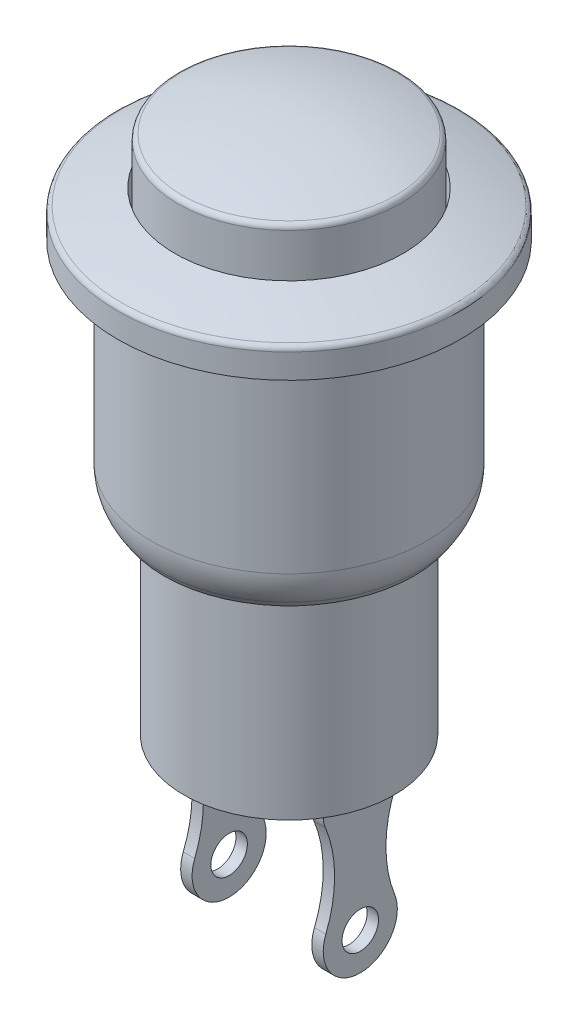
ISO-10303-21;
HEADER;
FILE_DESCRIPTION(('STEP AP214'),'2;1');
FILE_NAME('part.step','',(''),(''),'','','');
FILE_SCHEMA(('AUTOMOTIVE_DESIGN { 1 0 10303 214 1 1 1 1 }'));
ENDSEC;
DATA;
#1=APPLICATION_CONTEXT('core data for automotive mechanical design processes');
#2=APPLICATION_PROTOCOL_DEFINITION('international standard','automotive_design',2000,#1);
#3=PRODUCT_CONTEXT('',#1,'mechanical');
#4=PRODUCT('Part','Part','',(#3));
#5=PRODUCT_RELATED_PRODUCT_CATEGORY('part','',(#4));
#6=PRODUCT_DEFINITION_FORMATION('','',#4);
#7=PRODUCT_DEFINITION_CONTEXT('part definition',#1,'design');
#8=PRODUCT_DEFINITION('design','',#6,#7);
#9=PRODUCT_DEFINITION_SHAPE('','',#8);
#10=(LENGTH_UNIT() NAMED_UNIT(*) SI_UNIT(.MILLI.,.METRE.));
#11=(NAMED_UNIT(*) PLANE_ANGLE_UNIT() SI_UNIT($,.RADIAN.));
#12=(NAMED_UNIT(*) SI_UNIT($,.STERADIAN.) SOLID_ANGLE_UNIT());
#13=UNCERTAINTY_MEASURE_WITH_UNIT(LENGTH_MEASURE(1.E-05),#10,'distance_accuracy_value','');
#14=(GEOMETRIC_REPRESENTATION_CONTEXT(3) GLOBAL_UNCERTAINTY_ASSIGNED_CONTEXT((#13)) GLOBAL_UNIT_ASSIGNED_CONTEXT((#10,
#11,#12)) REPRESENTATION_CONTEXT('',''));
#15=CARTESIAN_POINT('',(0.,0.,0.));
#16=DIRECTION('',(0.,0.,1.));
#17=DIRECTION('',(1.,0.,0.));
#18=AXIS2_PLACEMENT_3D('',#15,#16,#17);
#19=CARTESIAN_POINT('',(-2.5,-6.,-1.3));
#20=DIRECTION('',(0.,0.,1.));
#21=DIRECTION('',(1.,0.,0.));
#22=AXIS2_PLACEMENT_3D('',#19,#20,#21);
#23=PLANE('',#22);
#24=DIRECTION('',(0.,1.,0.));
#25=VECTOR('',#24,1.);
#26=CARTESIAN_POINT('',(-2.1,-6.,-1.3));
#27=LINE('',#26,#25);
#28=CARTESIAN_POINT('',(-2.1,-0.59175240236366,-1.3));
#29=VERTEX_POINT('',#28);
#30=CARTESIAN_POINT('',(-2.1,0.,-1.3));
#31=VERTEX_POINT('',#30);
#32=EDGE_CURVE('E240',#29,#31,#27,.T.);
#33=ORIENTED_EDGE('',*,*,#32,.F.);
#34=DIRECTION('',(-1.,0.,0.));
#35=VECTOR('',#34,1.);
#36=CARTESIAN_POINT('',(-2.5,-0.59175240236366,-1.3));
#37=LINE('',#36,#35);
#38=CARTESIAN_POINT('',(-2.5,-0.59175240236366,-1.3));
#39=VERTEX_POINT('',#38);
#40=EDGE_CURVE('E45',#29,#39,#37,.T.);
#41=ORIENTED_EDGE('',*,*,#40,.T.);
#42=DIRECTION('',(0.,1.,0.));
#43=VECTOR('',#42,1.);
#44=CARTESIAN_POINT('',(-2.5,-6.,-1.3));
#45=LINE('',#44,#43);
#46=CARTESIAN_POINT('',(-2.5,0.,-1.3));
#47=VERTEX_POINT('',#46);
#48=EDGE_CURVE('E242',#39,#47,#45,.T.);
#49=ORIENTED_EDGE('',*,*,#48,.T.);
#50=DIRECTION('',(1.,0.,0.));
#51=VECTOR('',#50,1.);
#52=CARTESIAN_POINT('',(-2.5,0.,-1.3));
#53=LINE('',#52,#51);
#54=EDGE_CURVE('E227',#47,#31,#53,.T.);
#55=ORIENTED_EDGE('',*,*,#54,.T.);
#56=EDGE_LOOP('',(#33,#41,#49,#55));
#57=FACE_BOUND('',#56,.T.);
#58=ADVANCED_FACE('F37',(#57),#23,.F.);
#59=CARTESIAN_POINT('',(2.5,-6.,-1.3));
#60=DIRECTION('',(0.,0.,1.));
#61=DIRECTION('',(1.,0.,0.));
#62=AXIS2_PLACEMENT_3D('',#59,#60,#61);
#63=PLANE('',#62);
#64=DIRECTION('',(0.,1.,0.));
#65=VECTOR('',#64,1.);
#66=CARTESIAN_POINT('',(2.5,-6.,-1.3));
#67=LINE('',#66,#65);
#68=CARTESIAN_POINT('',(2.5,-0.59175240236366,-1.3));
#69=VERTEX_POINT('',#68);
#70=CARTESIAN_POINT('',(2.5,0.,-1.3));
#71=VERTEX_POINT('',#70);
#72=EDGE_CURVE('E218',#69,#71,#67,.T.);
#73=ORIENTED_EDGE('',*,*,#72,.F.);
#74=DIRECTION('',(-1.,0.,0.));
#75=VECTOR('',#74,1.);
#76=CARTESIAN_POINT('',(2.5,-0.59175240236366,-1.3));
#77=LINE('',#76,#75);
#78=CARTESIAN_POINT('',(2.1,-0.59175240236366,-1.3));
#79=VERTEX_POINT('',#78);
#80=EDGE_CURVE('E316',#69,#79,#77,.T.);
#81=ORIENTED_EDGE('',*,*,#80,.T.);
#82=DIRECTION('',(0.,1.,0.));
#83=VECTOR('',#82,1.);
#84=CARTESIAN_POINT('',(2.1,-6.,-1.3));
#85=LINE('',#84,#83);
#86=CARTESIAN_POINT('',(2.1,0.,-1.3));
#87=VERTEX_POINT('',#86);
#88=EDGE_CURVE('E220',#79,#87,#85,.T.);
#89=ORIENTED_EDGE('',*,*,#88,.T.);
#90=DIRECTION('',(1.,0.,0.));
#91=VECTOR('',#90,1.);
#92=CARTESIAN_POINT('',(2.5,0.,-1.3));
#93=LINE('',#92,#91);
#94=EDGE_CURVE('E210',#87,#71,#93,.T.);
#95=ORIENTED_EDGE('',*,*,#94,.T.);
#96=EDGE_LOOP('',(#73,#81,#89,#95));
#97=FACE_BOUND('',#96,.T.);
#98=ADVANCED_FACE('F354',(#97),#63,.F.);
#99=CARTESIAN_POINT('',(0.,0.,0.));
#100=DIRECTION('',(0.,-1.,0.));
#101=DIRECTION('',(0.,0.,-1.));
#102=AXIS2_PLACEMENT_3D('',#99,#100,#101);
#103=PLANE('',#102);
#104=CARTESIAN_POINT('',(0.,0.,0.));
#105=DIRECTION('',(0.,-1.,0.));
#106=DIRECTION('',(0.,0.,-1.));
#107=AXIS2_PLACEMENT_3D('',#104,#105,#106);
#108=CIRCLE('',#107,3.69);
#109=CARTESIAN_POINT('',(0.,0.,-3.69));
#110=VERTEX_POINT('',#109);
#111=EDGE_CURVE('E253',#110,#110,#108,.T.);
#112=ORIENTED_EDGE('',*,*,#111,.T.);
#113=EDGE_LOOP('',(#112));
#114=FACE_BOUND('',#113,.T.);
#115=ORIENTED_EDGE('',*,*,#54,.F.);
#116=DIRECTION('',(0.,0.,-1.));
#117=VECTOR('',#116,1.);
#118=CARTESIAN_POINT('',(-2.5,0.,1.3));
#119=LINE('',#118,#117);
#120=CARTESIAN_POINT('',(-2.5,0.,1.3));
#121=VERTEX_POINT('',#120);
#122=EDGE_CURVE('E224',#121,#47,#119,.T.);
#123=ORIENTED_EDGE('',*,*,#122,.F.);
#124=DIRECTION('',(-1.,0.,0.));
#125=VECTOR('',#124,1.);
#126=CARTESIAN_POINT('',(-2.5,0.,1.3));
#127=LINE('',#126,#125);
#128=CARTESIAN_POINT('',(-2.1,0.,1.3));
#129=VERTEX_POINT('',#128);
#130=EDGE_CURVE('E233',#129,#121,#127,.T.);
#131=ORIENTED_EDGE('',*,*,#130,.F.);
#132=DIRECTION('',(0.,0.,1.));
#133=VECTOR('',#132,1.);
#134=CARTESIAN_POINT('',(-2.1,0.,1.3));
#135=LINE('',#134,#133);
#136=EDGE_CURVE('E230',#31,#129,#135,.T.);
#137=ORIENTED_EDGE('',*,*,#136,.F.);
#138=EDGE_LOOP('',(#115,#123,#131,#137));
#139=FACE_BOUND('',#138,.T.);
#140=DIRECTION('',(0.,0.,-1.));
#141=VECTOR('',#140,1.);
#142=CARTESIAN_POINT('',(2.1,0.,1.3));
#143=LINE('',#142,#141);
#144=CARTESIAN_POINT('',(2.1,0.,1.3));
#145=VERTEX_POINT('',#144);
#146=EDGE_CURVE('E207',#145,#87,#143,.T.);
#147=ORIENTED_EDGE('',*,*,#146,.F.);
#148=DIRECTION('',(-1.,0.,0.));
#149=VECTOR('',#148,1.);
#150=CARTESIAN_POINT('',(2.5,0.,1.3));
#151=LINE('',#150,#149);
#152=CARTESIAN_POINT('',(2.5,0.,1.3));
#153=VERTEX_POINT('',#152);
#154=EDGE_CURVE('E204',#153,#145,#151,.T.);
#155=ORIENTED_EDGE('',*,*,#154,.F.);
#156=DIRECTION('',(0.,0.,1.));
#157=VECTOR('',#156,1.);
#158=CARTESIAN_POINT('',(2.5,0.,1.3));
#159=LINE('',#158,#157);
#160=EDGE_CURVE('E213',#71,#153,#159,.T.);
#161=ORIENTED_EDGE('',*,*,#160,.F.);
#162=ORIENTED_EDGE('',*,*,#94,.F.);
#163=EDGE_LOOP('',(#147,#155,#161,#162));
#164=FACE_BOUND('',#163,.T.);
#165=ADVANCED_FACE('F331',(#114,#139,#164),#103,.T.);
#166=CARTESIAN_POINT('',(0.,0.,0.));
#167=DIRECTION('',(0.,-1.,0.));
#168=DIRECTION('',(0.,0.,-1.));
#169=AXIS2_PLACEMENT_3D('',#166,#167,#168);
#170=CYLINDRICAL_SURFACE('',#169,6.01);
#171=CARTESIAN_POINT('',(0.,15.8594915447855,0.));
#172=DIRECTION('',(0.,-1.,0.));
#173=DIRECTION('',(0.,0.,-1.));
#174=AXIS2_PLACEMENT_3D('',#171,#172,#173);
#175=CIRCLE('',#174,6.01);
#176=CARTESIAN_POINT('',(0.,15.8594915447855,-6.01));
#177=VERTEX_POINT('',#176);
#178=EDGE_CURVE('E271',#177,#177,#175,.T.);
#179=ORIENTED_EDGE('',*,*,#178,.T.);
#180=EDGE_LOOP('',(#179));
#181=FACE_BOUND('',#180,.T.);
#182=CARTESIAN_POINT('',(0.,15.,0.));
#183=DIRECTION('',(0.,-1.,0.));
#184=DIRECTION('',(0.,0.,-1.));
#185=AXIS2_PLACEMENT_3D('',#182,#183,#184);
#186=CIRCLE('',#185,6.01);
#187=CARTESIAN_POINT('',(0.,15.,-6.01));
#188=VERTEX_POINT('',#187);
#189=EDGE_CURVE('E244',#188,#188,#186,.T.);
#190=ORIENTED_EDGE('',*,*,#189,.F.);
#191=EDGE_LOOP('',(#190));
#192=FACE_BOUND('',#191,.T.);
#193=ADVANCED_FACE('F386',(#181,#192),#170,.T.);
#194=CARTESIAN_POINT('',(0.,-0.466749999999985,0.));
#195=DIRECTION('',(0.,-1.,0.));
#196=DIRECTION('',(1.,0.,0.));
#197=AXIS2_PLACEMENT_3D('',#194,#195,#196);
#198=SPHERICAL_SURFACE('',#197,17.5292314595506);
#199=CARTESIAN_POINT('',(0.,16.0479158448809,0.));
#200=DIRECTION('',(0.,-1.,0.));
#201=DIRECTION('',(0.,0.,-1.));
#202=AXIS2_PLACEMENT_3D('',#199,#200,#201);
#203=CIRCLE('',#202,5.87705432971521);
#204=CARTESIAN_POINT('',(0.,16.0479158448809,-5.87705432971521));
#205=VERTEX_POINT('',#204);
#206=EDGE_CURVE('E274',#205,#205,#203,.F.);
#207=ORIENTED_EDGE('',*,*,#206,.T.);
#208=EDGE_LOOP('',(#207));
#209=FACE_BOUND('',#208,.T.);
#210=CARTESIAN_POINT('',(0.,16.6,0.));
#211=DIRECTION('',(0.,-1.,0.));
#212=DIRECTION('',(0.,0.,-1.));
#213=AXIS2_PLACEMENT_3D('',#210,#211,#212);
#214=CIRCLE('',#213,4.);
#215=CARTESIAN_POINT('',(0.,16.6,-4.));
#216=VERTEX_POINT('',#215);
#217=EDGE_CURVE('E262',#216,#216,#214,.T.);
#218=ORIENTED_EDGE('',*,*,#217,.T.);
#219=EDGE_LOOP('',(#218));
#220=FACE_BOUND('',#219,.T.);
#221=ADVANCED_FACE('F402',(#209,#220),#198,.T.);
#222=CARTESIAN_POINT('',(0.,0.,0.));
#223=DIRECTION('',(0.,-1.,0.));
#224=DIRECTION('',(0.,0.,-1.));
#225=AXIS2_PLACEMENT_3D('',#222,#223,#224);
#226=CYLINDRICAL_SURFACE('',#225,4.);
#227=CARTESIAN_POINT('',(0.,15.0131906379404,0.));
#228=DIRECTION('',(0.,-1.,0.));
#229=DIRECTION('',(0.,0.,-1.));
#230=AXIS2_PLACEMENT_3D('',#227,#228,#229);
#231=CIRCLE('',#230,4.);
#232=CARTESIAN_POINT('',(0.,15.0131906379404,-4.));
#233=VERTEX_POINT('',#232);
#234=EDGE_CURVE('E259',#233,#233,#231,.T.);
#235=ORIENTED_EDGE('',*,*,#234,.T.);
#236=EDGE_LOOP('',(#235));
#237=FACE_BOUND('',#236,.T.);
#238=ORIENTED_EDGE('',*,*,#217,.F.);
#239=EDGE_LOOP('',(#238));
#240=FACE_BOUND('',#239,.T.);
#241=ADVANCED_FACE('F398',(#237,#240),#226,.F.);
#242=CARTESIAN_POINT('',(0.,15.0131906379404,0.));
#243=DIRECTION('',(0.,1.,0.));
#244=DIRECTION('',(0.,0.,1.));
#245=AXIS2_PLACEMENT_3D('',#242,#243,#244);
#246=PLANE('',#245);
#247=CARTESIAN_POINT('',(0.,15.0131906379404,0.));
#248=DIRECTION('',(0.,-1.,0.));
#249=DIRECTION('',(0.,0.,-1.));
#250=AXIS2_PLACEMENT_3D('',#247,#248,#249);
#251=CIRCLE('',#250,3.89);
#252=CARTESIAN_POINT('',(0.,15.0131906379404,-3.89));
#253=VERTEX_POINT('',#252);
#254=EDGE_CURVE('E256',#253,#253,#251,.T.);
#255=ORIENTED_EDGE('',*,*,#254,.T.);
#256=EDGE_LOOP('',(#255));
#257=FACE_BOUND('',#256,.T.);
#258=ORIENTED_EDGE('',*,*,#234,.F.);
#259=EDGE_LOOP('',(#258));
#260=FACE_BOUND('',#259,.T.);
#261=ADVANCED_FACE('F394',(#257,#260),#246,.T.);
#262=CARTESIAN_POINT('',(0.,0.,0.));
#263=DIRECTION('',(0.,-1.,0.));
#264=DIRECTION('',(0.,0.,-1.));
#265=AXIS2_PLACEMENT_3D('',#262,#263,#264);
#266=CYLINDRICAL_SURFACE('',#265,3.89);
#267=CARTESIAN_POINT('',(0.,18.0525692696262,0.));
#268=DIRECTION('',(0.,-1.,0.));
#269=DIRECTION('',(0.,0.,-1.));
#270=AXIS2_PLACEMENT_3D('',#267,#268,#269);
#271=CIRCLE('',#270,3.89);
#272=CARTESIAN_POINT('',(0.,18.0525692696262,-3.89));
#273=VERTEX_POINT('',#272);
#274=EDGE_CURVE('E265',#273,#273,#271,.T.);
#275=ORIENTED_EDGE('',*,*,#274,.T.);
#276=EDGE_LOOP('',(#275));
#277=FACE_BOUND('',#276,.T.);
#278=ORIENTED_EDGE('',*,*,#254,.F.);
#279=EDGE_LOOP('',(#278));
#280=FACE_BOUND('',#279,.T.);
#281=ADVANCED_FACE('F390',(#277,#280),#266,.T.);
#282=CARTESIAN_POINT('',(0.,5.88991666666667,0.));
#283=DIRECTION('',(0.,-1.,0.));
#284=DIRECTION('',(1.,0.,0.));
#285=AXIS2_PLACEMENT_3D('',#282,#283,#284);
#286=SPHERICAL_SURFACE('',#285,12.9100833333333);
#287=CARTESIAN_POINT('',(0.,18.2439551525348,0.));
#288=DIRECTION('',(0.,-1.,0.));
#289=DIRECTION('',(0.,0.,-1.));
#290=AXIS2_PLACEMENT_3D('',#287,#288,#289);
#291=CIRCLE('',#290,3.74806413543053);
#292=CARTESIAN_POINT('',(0.,18.2439551525348,-3.74806413543053));
#293=VERTEX_POINT('',#292);
#294=EDGE_CURVE('E268',#293,#293,#291,.F.);
#295=ORIENTED_EDGE('',*,*,#294,.T.);
#296=EDGE_LOOP('',(#295));
#297=FACE_BOUND('',#296,.T.);
#298=ADVANCED_FACE('F382',(#297),#286,.T.);
#299=CARTESIAN_POINT('',(0.,0.,0.));
#300=DIRECTION('',(0.,-1.,0.));
#301=DIRECTION('',(0.,0.,-1.));
#302=AXIS2_PLACEMENT_3D('',#299,#300,#301);
#303=CYLINDRICAL_SURFACE('',#302,3.69);
#304=CARTESIAN_POINT('',(0.,7.,0.));
#305=DIRECTION('',(0.,-1.,0.));
#306=DIRECTION('',(0.,0.,-1.));
#307=AXIS2_PLACEMENT_3D('',#304,#305,#306);
#308=CIRCLE('',#307,3.69);
#309=CARTESIAN_POINT('',(0.,7.,-3.69));
#310=VERTEX_POINT('',#309);
#311=EDGE_CURVE('E250',#310,#310,#308,.T.);
#312=ORIENTED_EDGE('',*,*,#311,.T.);
#313=EDGE_LOOP('',(#312));
#314=FACE_BOUND('',#313,.T.);
#315=ORIENTED_EDGE('',*,*,#111,.F.);
#316=EDGE_LOOP('',(#315));
#317=FACE_BOUND('',#316,.T.);
#318=ADVANCED_FACE('F378',(#314,#317),#303,.T.);
#319=CARTESIAN_POINT('',(0.,7.,0.));
#320=DIRECTION('',(0.,-1.,0.));
#321=DIRECTION('',(0.,0.,-1.));
#322=AXIS2_PLACEMENT_3D('',#319,#320,#321);
#323=PLANE('',#322);
#324=CARTESIAN_POINT('',(0.,7.,0.));
#325=DIRECTION('',(0.,-1.,0.));
#326=DIRECTION('',(0.,0.,-1.));
#327=AXIS2_PLACEMENT_3D('',#324,#325,#326);
#328=CIRCLE('',#327,4.38541468476175);
#329=CARTESIAN_POINT('',(0.,7.,-4.38541468476175));
#330=VERTEX_POINT('',#329);
#331=EDGE_CURVE('E277',#330,#330,#328,.T.);
#332=ORIENTED_EDGE('',*,*,#331,.T.);
#333=EDGE_LOOP('',(#332));
#334=FACE_BOUND('',#333,.T.);
#335=ORIENTED_EDGE('',*,*,#311,.F.);
#336=EDGE_LOOP('',(#335));
#337=FACE_BOUND('',#336,.T.);
#338=ADVANCED_FACE('F374',(#334,#337),#323,.T.);
#339=CARTESIAN_POINT('',(0.,0.,0.));
#340=DIRECTION('',(0.,-1.,0.));
#341=DIRECTION('',(0.,0.,-1.));
#342=AXIS2_PLACEMENT_3D('',#339,#340,#341);
#343=CYLINDRICAL_SURFACE('',#342,4.84);
#344=CARTESIAN_POINT('',(0.,8.29242698992415,0.));
#345=DIRECTION('',(0.,-1.,0.));
#346=DIRECTION('',(0.,0.,-1.));
#347=AXIS2_PLACEMENT_3D('',#344,#345,#346);
#348=CIRCLE('',#347,4.84);
#349=CARTESIAN_POINT('',(0.,8.29242698992415,-4.84));
#350=VERTEX_POINT('',#349);
#351=EDGE_CURVE('E280',#350,#350,#348,.F.);
#352=ORIENTED_EDGE('',*,*,#351,.T.);
#353=EDGE_LOOP('',(#352));
#354=FACE_BOUND('',#353,.T.);
#355=CARTESIAN_POINT('',(0.,15.,0.));
#356=DIRECTION('',(0.,-1.,0.));
#357=DIRECTION('',(0.,0.,-1.));
#358=AXIS2_PLACEMENT_3D('',#355,#356,#357);
#359=CIRCLE('',#358,4.84);
#360=CARTESIAN_POINT('',(0.,15.,-4.84));
#361=VERTEX_POINT('',#360);
#362=EDGE_CURVE('E247',#361,#361,#359,.T.);
#363=ORIENTED_EDGE('',*,*,#362,.T.);
#364=EDGE_LOOP('',(#363));
#365=FACE_BOUND('',#364,.T.);
#366=ADVANCED_FACE('F370',(#354,#365),#343,.T.);
#367=CARTESIAN_POINT('',(0.,15.,0.));
#368=DIRECTION('',(0.,-1.,0.));
#369=DIRECTION('',(0.,0.,-1.));
#370=AXIS2_PLACEMENT_3D('',#367,#368,#369);
#371=PLANE('',#370);
#372=ORIENTED_EDGE('',*,*,#189,.T.);
#373=EDGE_LOOP('',(#372));
#374=FACE_BOUND('',#373,.T.);
#375=ORIENTED_EDGE('',*,*,#362,.F.);
#376=EDGE_LOOP('',(#375));
#377=FACE_BOUND('',#376,.T.);
#378=ADVANCED_FACE('F366',(#374,#377),#371,.T.);
#379=CARTESIAN_POINT('',(0.,18.0525692696262,0.));
#380=DIRECTION('',(0.,-1.,0.));
#381=DIRECTION('',(0.,0.,-1.));
#382=AXIS2_PLACEMENT_3D('',#379,#380,#381);
#383=TOROIDAL_SURFACE('',#382,3.69,0.2);
#384=ORIENTED_EDGE('',*,*,#294,.F.);
#385=EDGE_LOOP('',(#384));
#386=FACE_BOUND('',#385,.T.);
#387=ORIENTED_EDGE('',*,*,#274,.F.);
#388=EDGE_LOOP('',(#387));
#389=FACE_BOUND('',#388,.T.);
#390=ADVANCED_FACE('F369',(#386,#389),#383,.T.);
#391=CARTESIAN_POINT('',(0.,15.8594915447855,0.));
#392=DIRECTION('',(0.,-1.,0.));
#393=DIRECTION('',(0.,0.,-1.));
#394=AXIS2_PLACEMENT_3D('',#391,#392,#393);
#395=TOROIDAL_SURFACE('',#394,5.81,0.2);
#396=ORIENTED_EDGE('',*,*,#206,.F.);
#397=EDGE_LOOP('',(#396));
#398=FACE_BOUND('',#397,.T.);
#399=ORIENTED_EDGE('',*,*,#178,.F.);
#400=EDGE_LOOP('',(#399));
#401=FACE_BOUND('',#400,.T.);
#402=ADVANCED_FACE('F412',(#398,#401),#395,.T.);
#403=CARTESIAN_POINT('',(0.,7.,0.));
#404=DIRECTION('',(0.,1.,0.));
#405=DIRECTION('',(0.,0.,1.));
#406=AXIS2_PLACEMENT_3D('',#403,#404,#405);
#407=CONICAL_SURFACE('',#406,4.38541468476175,0.575958653158124);
#408=CARTESIAN_POINT('',(0.,7.2031489198941,0.));
#409=DIRECTION('',(0.,-1.,0.));
#410=DIRECTION('',(0.,0.,-1.));
#411=AXIS2_PLACEMENT_3D('',#408,#409,#410);
#412=CIRCLE('',#411,4.51734113589085);
#413=CARTESIAN_POINT('',(0.,7.2031489198941,-4.51734113589085));
#414=VERTEX_POINT('',#413);
#415=EDGE_CURVE('E283',#414,#414,#412,.T.);
#416=ORIENTED_EDGE('',*,*,#415,.T.);
#417=EDGE_LOOP('',(#416));
#418=FACE_BOUND('',#417,.T.);
#419=ORIENTED_EDGE('',*,*,#331,.F.);
#420=EDGE_LOOP('',(#419));
#421=FACE_BOUND('',#420,.T.);
#422=ADVANCED_FACE('F416',(#418,#421),#407,.T.);
#423=CARTESIAN_POINT('',(0.,8.29242698992415,0.));
#424=DIRECTION('',(0.,-1.,0.));
#425=DIRECTION('',(0.,0.,-1.));
#426=AXIS2_PLACEMENT_3D('',#423,#424,#425);
#427=TOROIDAL_SURFACE('',#426,2.84,2.);
#428=ORIENTED_EDGE('',*,*,#415,.F.);
#429=EDGE_LOOP('',(#428));
#430=FACE_BOUND('',#429,.T.);
#431=ORIENTED_EDGE('',*,*,#351,.F.);
#432=EDGE_LOOP('',(#431));
#433=FACE_BOUND('',#432,.T.);
#434=ADVANCED_FACE('F364',(#430,#433),#427,.T.);
#435=CARTESIAN_POINT('',(-2.5,-6.,1.3));
#436=DIRECTION('',(1.,0.,0.));
#437=DIRECTION('',(0.,0.,-1.));
#438=AXIS2_PLACEMENT_3D('',#435,#436,#437);
#439=PLANE('',#438);
#440=CARTESIAN_POINT('',(-2.5,-4.7,0.));
#441=DIRECTION('',(-1.,0.,0.));
#442=DIRECTION('',(0.,0.,1.));
#443=AXIS2_PLACEMENT_3D('',#440,#441,#442);
#444=CIRCLE('',#443,0.64);
#445=CARTESIAN_POINT('',(-2.5,-4.7,0.64));
#446=VERTEX_POINT('',#445);
#447=EDGE_CURVE('E194',#446,#446,#444,.T.);
#448=ORIENTED_EDGE('',*,*,#447,.F.);
#449=EDGE_LOOP('',(#448));
#450=FACE_BOUND('',#449,.T.);
#451=CARTESIAN_POINT('',(-2.5,-2.61666666666667,5.22534722222222));
#452=DIRECTION('',(-1.,0.,0.));
#453=DIRECTION('',(0.,0.,-1.));
#454=AXIS2_PLACEMENT_3D('',#451,#452,#453);
#455=CIRCLE('',#454,4.32534722222222);
#456=CARTESIAN_POINT('',(-2.5,-0.971993197903382,1.22488752689574));
#457=VERTEX_POINT('',#456);
#458=CARTESIAN_POINT('',(-2.5,-4.2185482377631,1.20756126165052));
#459=VERTEX_POINT('',#458);
#460=EDGE_CURVE('E151',#457,#459,#455,.T.);
#461=ORIENTED_EDGE('',*,*,#460,.F.);
#462=CARTESIAN_POINT('',(-2.5,-0.591752402363664,0.299999999999999));
#463=DIRECTION('',(1.,0.,0.));
#464=DIRECTION('',(0.,0.,-1.));
#465=AXIS2_PLACEMENT_3D('',#462,#463,#464);
#466=CIRCLE('',#465,1.);
#467=CARTESIAN_POINT('',(-2.5,-0.591752402363664,1.3));
#468=VERTEX_POINT('',#467);
#469=EDGE_CURVE('E309',#457,#468,#466,.F.);
#470=ORIENTED_EDGE('',*,*,#469,.T.);
#471=DIRECTION('',(0.,1.,0.));
#472=VECTOR('',#471,1.);
#473=CARTESIAN_POINT('',(-2.5,-6.,1.3));
#474=LINE('',#473,#472);
#475=EDGE_CURVE('E236',#468,#121,#474,.T.);
#476=ORIENTED_EDGE('',*,*,#475,.T.);
#477=ORIENTED_EDGE('',*,*,#122,.T.);
#478=ORIENTED_EDGE('',*,*,#48,.F.);
#479=CARTESIAN_POINT('',(-2.5,-0.59175240236366,-0.300000000000001));
#480=DIRECTION('',(1.,0.,0.));
#481=DIRECTION('',(0.,0.,-1.));
#482=AXIS2_PLACEMENT_3D('',#479,#480,#481);
#483=CIRCLE('',#482,1.);
#484=CARTESIAN_POINT('',(-2.5,-0.971993197903378,-1.22488752689574));
#485=VERTEX_POINT('',#484);
#486=EDGE_CURVE('E307',#39,#485,#483,.F.);
#487=ORIENTED_EDGE('',*,*,#486,.T.);
#488=CARTESIAN_POINT('',(-2.5,-2.61666666666667,-5.22534722222222));
#489=DIRECTION('',(-1.,0.,0.));
#490=DIRECTION('',(0.,0.,1.));
#491=AXIS2_PLACEMENT_3D('',#488,#489,#490);
#492=CIRCLE('',#491,4.32534722222222);
#493=CARTESIAN_POINT('',(-2.5,-4.2185482377631,-1.20756126165051));
#494=VERTEX_POINT('',#493);
#495=EDGE_CURVE('E165',#494,#485,#492,.T.);
#496=ORIENTED_EDGE('',*,*,#495,.F.);
#497=CARTESIAN_POINT('',(-2.5,-4.7,0.));
#498=DIRECTION('',(1.,0.,0.));
#499=DIRECTION('',(0.,0.,1.));
#500=AXIS2_PLACEMENT_3D('',#497,#498,#499);
#501=CIRCLE('',#500,1.3);
#502=EDGE_CURVE('E160',#459,#494,#501,.T.);
#503=ORIENTED_EDGE('',*,*,#502,.F.);
#504=EDGE_LOOP('',(#461,#470,#476,#477,#478,#487,#496,#503));
#505=FACE_BOUND('',#504,.T.);
#506=ADVANCED_FACE('F164',(#450,#505),#439,.F.);
#507=CARTESIAN_POINT('',(-2.1,-6.,1.3));
#508=DIRECTION('',(-1.,0.,0.));
#509=DIRECTION('',(0.,0.,1.));
#510=AXIS2_PLACEMENT_3D('',#507,#508,#509);
#511=PLANE('',#510);
#512=CARTESIAN_POINT('',(-2.1,-4.7,0.));
#513=DIRECTION('',(-1.,0.,0.));
#514=DIRECTION('',(0.,0.,1.));
#515=AXIS2_PLACEMENT_3D('',#512,#513,#514);
#516=CIRCLE('',#515,0.64);
#517=CARTESIAN_POINT('',(-2.1,-4.7,0.64));
#518=VERTEX_POINT('',#517);
#519=EDGE_CURVE('E201',#518,#518,#516,.T.);
#520=ORIENTED_EDGE('',*,*,#519,.T.);
#521=EDGE_LOOP('',(#520));
#522=FACE_BOUND('',#521,.T.);
#523=DIRECTION('',(0.,1.,0.));
#524=VECTOR('',#523,1.);
#525=CARTESIAN_POINT('',(-2.1,-6.,1.3));
#526=LINE('',#525,#524);
#527=CARTESIAN_POINT('',(-2.1,-0.591752402363664,1.3));
#528=VERTEX_POINT('',#527);
#529=EDGE_CURVE('E238',#528,#129,#526,.T.);
#530=ORIENTED_EDGE('',*,*,#529,.F.);
#531=CARTESIAN_POINT('',(-2.1,-0.591752402363664,0.299999999999999));
#532=DIRECTION('',(-1.,0.,0.));
#533=DIRECTION('',(0.,0.,1.));
#534=AXIS2_PLACEMENT_3D('',#531,#532,#533);
#535=CIRCLE('',#534,1.);
#536=CARTESIAN_POINT('',(-2.1,-0.971993197903382,1.22488752689574));
#537=VERTEX_POINT('',#536);
#538=EDGE_CURVE('E314',#528,#537,#535,.F.);
#539=ORIENTED_EDGE('',*,*,#538,.T.);
#540=CARTESIAN_POINT('',(-2.1,-2.61666666666667,5.22534722222222));
#541=DIRECTION('',(-1.,0.,0.));
#542=DIRECTION('',(0.,0.,1.));
#543=AXIS2_PLACEMENT_3D('',#540,#541,#542);
#544=CIRCLE('',#543,4.32534722222222);
#545=CARTESIAN_POINT('',(-2.1,-4.2185482377631,1.20756126165052));
#546=VERTEX_POINT('',#545);
#547=EDGE_CURVE('E192',#537,#546,#544,.T.);
#548=ORIENTED_EDGE('',*,*,#547,.T.);
#549=CARTESIAN_POINT('',(-2.1,-4.7,0.));
#550=DIRECTION('',(-1.,0.,0.));
#551=DIRECTION('',(0.,0.,1.));
#552=AXIS2_PLACEMENT_3D('',#549,#550,#551);
#553=CIRCLE('',#552,1.3);
#554=CARTESIAN_POINT('',(-2.1,-4.2185482377631,-1.20756126165051));
#555=VERTEX_POINT('',#554);
#556=EDGE_CURVE('E171',#546,#555,#553,.F.);
#557=ORIENTED_EDGE('',*,*,#556,.T.);
#558=CARTESIAN_POINT('',(-2.1,-2.61666666666667,-5.22534722222222));
#559=DIRECTION('',(-1.,0.,0.));
#560=DIRECTION('',(0.,0.,1.));
#561=AXIS2_PLACEMENT_3D('',#558,#559,#560);
#562=CIRCLE('',#561,4.32534722222222);
#563=CARTESIAN_POINT('',(-2.1,-0.971993197903378,-1.22488752689574));
#564=VERTEX_POINT('',#563);
#565=EDGE_CURVE('E187',#555,#564,#562,.T.);
#566=ORIENTED_EDGE('',*,*,#565,.T.);
#567=CARTESIAN_POINT('',(-2.1,-0.59175240236366,-0.300000000000001));
#568=DIRECTION('',(-1.,0.,0.));
#569=DIRECTION('',(0.,0.,1.));
#570=AXIS2_PLACEMENT_3D('',#567,#568,#569);
#571=CIRCLE('',#570,1.);
#572=EDGE_CURVE('E52',#564,#29,#571,.F.);
#573=ORIENTED_EDGE('',*,*,#572,.T.);
#574=ORIENTED_EDGE('',*,*,#32,.T.);
#575=ORIENTED_EDGE('',*,*,#136,.T.);
#576=EDGE_LOOP('',(#530,#539,#548,#557,#566,#573,#574,#575));
#577=FACE_BOUND('',#576,.T.);
#578=ADVANCED_FACE('F334',(#522,#577),#511,.F.);
#579=CARTESIAN_POINT('',(-2.5,-6.,1.3));
#580=DIRECTION('',(0.,0.,-1.));
#581=DIRECTION('',(-1.,0.,0.));
#582=AXIS2_PLACEMENT_3D('',#579,#580,#581);
#583=PLANE('',#582);
#584=ORIENTED_EDGE('',*,*,#475,.F.);
#585=DIRECTION('',(-1.,0.,0.));
#586=VECTOR('',#585,1.);
#587=CARTESIAN_POINT('',(-2.5,-0.591752402363664,1.3));
#588=LINE('',#587,#586);
#589=EDGE_CURVE('E311',#468,#528,#588,.F.);
#590=ORIENTED_EDGE('',*,*,#589,.T.);
#591=ORIENTED_EDGE('',*,*,#529,.T.);
#592=ORIENTED_EDGE('',*,*,#130,.T.);
#593=EDGE_LOOP('',(#584,#590,#591,#592));
#594=FACE_BOUND('',#593,.T.);
#595=ADVANCED_FACE('F340',(#594),#583,.F.);
#596=CARTESIAN_POINT('',(2.5,-6.,1.3));
#597=DIRECTION('',(0.,0.,-1.));
#598=DIRECTION('',(-1.,0.,0.));
#599=AXIS2_PLACEMENT_3D('',#596,#597,#598);
#600=PLANE('',#599);
#601=DIRECTION('',(0.,1.,0.));
#602=VECTOR('',#601,1.);
#603=CARTESIAN_POINT('',(2.1,-6.,1.3));
#604=LINE('',#603,#602);
#605=CARTESIAN_POINT('',(2.1,-0.591752402363664,1.3));
#606=VERTEX_POINT('',#605);
#607=EDGE_CURVE('E222',#606,#145,#604,.T.);
#608=ORIENTED_EDGE('',*,*,#607,.F.);
#609=DIRECTION('',(-1.,0.,0.));
#610=VECTOR('',#609,1.);
#611=CARTESIAN_POINT('',(2.5,-0.591752402363664,1.3));
#612=LINE('',#611,#610);
#613=CARTESIAN_POINT('',(2.5,-0.591752402363664,1.3));
#614=VERTEX_POINT('',#613);
#615=EDGE_CURVE('E300',#606,#614,#612,.F.);
#616=ORIENTED_EDGE('',*,*,#615,.T.);
#617=DIRECTION('',(0.,1.,0.));
#618=VECTOR('',#617,1.);
#619=CARTESIAN_POINT('',(2.5,-6.,1.3));
#620=LINE('',#619,#618);
#621=EDGE_CURVE('E216',#614,#153,#620,.T.);
#622=ORIENTED_EDGE('',*,*,#621,.T.);
#623=ORIENTED_EDGE('',*,*,#154,.T.);
#624=EDGE_LOOP('',(#608,#616,#622,#623));
#625=FACE_BOUND('',#624,.T.);
#626=ADVANCED_FACE('F342',(#625),#600,.F.);
#627=CARTESIAN_POINT('',(2.1,-6.,1.3));
#628=DIRECTION('',(1.,0.,0.));
#629=DIRECTION('',(0.,0.,-1.));
#630=AXIS2_PLACEMENT_3D('',#627,#628,#629);
#631=PLANE('',#630);
#632=CARTESIAN_POINT('',(2.1,-4.7,0.));
#633=DIRECTION('',(1.,0.,0.));
#634=DIRECTION('',(0.,0.,-1.));
#635=AXIS2_PLACEMENT_3D('',#632,#633,#634);
#636=CIRCLE('',#635,0.64);
#637=CARTESIAN_POINT('',(2.1,-4.7,-0.639999999999999));
#638=VERTEX_POINT('',#637);
#639=EDGE_CURVE('E198',#638,#638,#636,.T.);
#640=ORIENTED_EDGE('',*,*,#639,.T.);
#641=EDGE_LOOP('',(#640));
#642=FACE_BOUND('',#641,.T.);
#643=CARTESIAN_POINT('',(2.1,-2.61666666666667,5.22534722222222));
#644=DIRECTION('',(1.,0.,0.));
#645=DIRECTION('',(0.,0.,-1.));
#646=AXIS2_PLACEMENT_3D('',#643,#644,#645);
#647=CIRCLE('',#646,4.32534722222222);
#648=CARTESIAN_POINT('',(2.1,-4.2185482377631,1.20756126165052));
#649=VERTEX_POINT('',#648);
#650=CARTESIAN_POINT('',(2.1,-0.971993197903382,1.22488752689574));
#651=VERTEX_POINT('',#650);
#652=EDGE_CURVE('E189',#649,#651,#647,.T.);
#653=ORIENTED_EDGE('',*,*,#652,.T.);
#654=CARTESIAN_POINT('',(2.1,-0.591752402363664,0.3));
#655=DIRECTION('',(1.,0.,0.));
#656=DIRECTION('',(0.,0.,-1.));
#657=AXIS2_PLACEMENT_3D('',#654,#655,#656);
#658=CIRCLE('',#657,1.);
#659=EDGE_CURVE('E298',#651,#606,#658,.F.);
#660=ORIENTED_EDGE('',*,*,#659,.T.);
#661=ORIENTED_EDGE('',*,*,#607,.T.);
#662=ORIENTED_EDGE('',*,*,#146,.T.);
#663=ORIENTED_EDGE('',*,*,#88,.F.);
#664=CARTESIAN_POINT('',(2.1,-0.59175240236366,-0.3));
#665=DIRECTION('',(1.,0.,0.));
#666=DIRECTION('',(0.,0.,-1.));
#667=AXIS2_PLACEMENT_3D('',#664,#665,#666);
#668=CIRCLE('',#667,1.);
#669=CARTESIAN_POINT('',(2.1,-0.971993197903378,-1.22488752689574));
#670=VERTEX_POINT('',#669);
#671=EDGE_CURVE('E296',#79,#670,#668,.F.);
#672=ORIENTED_EDGE('',*,*,#671,.T.);
#673=CARTESIAN_POINT('',(2.1,-2.61666666666667,-5.22534722222222));
#674=DIRECTION('',(1.,0.,0.));
#675=DIRECTION('',(0.,0.,-1.));
#676=AXIS2_PLACEMENT_3D('',#673,#674,#675);
#677=CIRCLE('',#676,4.32534722222222);
#678=CARTESIAN_POINT('',(2.1,-4.2185482377631,-1.20756126165051));
#679=VERTEX_POINT('',#678);
#680=EDGE_CURVE('E185',#670,#679,#677,.T.);
#681=ORIENTED_EDGE('',*,*,#680,.T.);
#682=CARTESIAN_POINT('',(2.1,-4.7,0.));
#683=DIRECTION('',(1.,0.,0.));
#684=DIRECTION('',(0.,0.,-1.));
#685=AXIS2_PLACEMENT_3D('',#682,#683,#684);
#686=CIRCLE('',#685,1.3);
#687=EDGE_CURVE('E181',#679,#649,#686,.F.);
#688=ORIENTED_EDGE('',*,*,#687,.T.);
#689=EDGE_LOOP('',(#653,#660,#661,#662,#663,#672,#681,#688));
#690=FACE_BOUND('',#689,.T.);
#691=ADVANCED_FACE('F348',(#642,#690),#631,.F.);
#692=CARTESIAN_POINT('',(2.5,-6.,1.3));
#693=DIRECTION('',(-1.,0.,0.));
#694=DIRECTION('',(0.,0.,1.));
#695=AXIS2_PLACEMENT_3D('',#692,#693,#694);
#696=PLANE('',#695);
#697=CARTESIAN_POINT('',(2.5,-4.7,0.));
#698=DIRECTION('',(-1.,0.,0.));
#699=DIRECTION('',(0.,0.,1.));
#700=AXIS2_PLACEMENT_3D('',#697,#698,#699);
#701=CIRCLE('',#700,0.64);
#702=CARTESIAN_POINT('',(2.5,-4.7,0.640000000000001));
#703=VERTEX_POINT('',#702);
#704=EDGE_CURVE('E197',#703,#703,#701,.T.);
#705=ORIENTED_EDGE('',*,*,#704,.T.);
#706=EDGE_LOOP('',(#705));
#707=FACE_BOUND('',#706,.T.);
#708=ORIENTED_EDGE('',*,*,#621,.F.);
#709=CARTESIAN_POINT('',(2.5,-0.591752402363664,0.3));
#710=DIRECTION('',(-1.,0.,0.));
#711=DIRECTION('',(0.,0.,1.));
#712=AXIS2_PLACEMENT_3D('',#709,#710,#711);
#713=CIRCLE('',#712,1.);
#714=CARTESIAN_POINT('',(2.5,-0.971993197903382,1.22488752689574));
#715=VERTEX_POINT('',#714);
#716=EDGE_CURVE('E304',#614,#715,#713,.F.);
#717=ORIENTED_EDGE('',*,*,#716,.T.);
#718=CARTESIAN_POINT('',(2.5,-2.61666666666667,5.22534722222222));
#719=DIRECTION('',(-1.,0.,0.));
#720=DIRECTION('',(0.,0.,1.));
#721=AXIS2_PLACEMENT_3D('',#718,#719,#720);
#722=CIRCLE('',#721,4.32534722222222);
#723=CARTESIAN_POINT('',(2.5,-4.2185482377631,1.20756126165052));
#724=VERTEX_POINT('',#723);
#725=EDGE_CURVE('E291',#715,#724,#722,.T.);
#726=ORIENTED_EDGE('',*,*,#725,.T.);
#727=CARTESIAN_POINT('',(2.5,-4.7,0.));
#728=DIRECTION('',(-1.,0.,0.));
#729=DIRECTION('',(0.,0.,1.));
#730=AXIS2_PLACEMENT_3D('',#727,#728,#729);
#731=CIRCLE('',#730,1.3);
#732=CARTESIAN_POINT('',(2.5,-4.2185482377631,-1.20756126165051));
#733=VERTEX_POINT('',#732);
#734=EDGE_CURVE('E179',#724,#733,#731,.F.);
#735=ORIENTED_EDGE('',*,*,#734,.T.);
#736=CARTESIAN_POINT('',(2.5,-2.61666666666667,-5.22534722222222));
#737=DIRECTION('',(-1.,0.,0.));
#738=DIRECTION('',(0.,0.,1.));
#739=AXIS2_PLACEMENT_3D('',#736,#737,#738);
#740=CIRCLE('',#739,4.32534722222222);
#741=CARTESIAN_POINT('',(2.5,-0.971993197903378,-1.22488752689574));
#742=VERTEX_POINT('',#741);
#743=EDGE_CURVE('E286',#733,#742,#740,.T.);
#744=ORIENTED_EDGE('',*,*,#743,.T.);
#745=CARTESIAN_POINT('',(2.5,-0.59175240236366,-0.3));
#746=DIRECTION('',(-1.,0.,0.));
#747=DIRECTION('',(0.,0.,1.));
#748=AXIS2_PLACEMENT_3D('',#745,#746,#747);
#749=CIRCLE('',#748,1.);
#750=EDGE_CURVE('E302',#742,#69,#749,.F.);
#751=ORIENTED_EDGE('',*,*,#750,.T.);
#752=ORIENTED_EDGE('',*,*,#72,.T.);
#753=ORIENTED_EDGE('',*,*,#160,.T.);
#754=EDGE_LOOP('',(#708,#717,#726,#735,#744,#751,#752,#753));
#755=FACE_BOUND('',#754,.T.);
#756=ADVANCED_FACE('F441',(#707,#755),#696,.F.);
#757=CARTESIAN_POINT('',(3.5,-4.7,0.));
#758=DIRECTION('',(-1.,0.,0.));
#759=DIRECTION('',(0.,0.,1.));
#760=AXIS2_PLACEMENT_3D('',#757,#758,#759);
#761=CYLINDRICAL_SURFACE('',#760,0.64);
#762=ORIENTED_EDGE('',*,*,#704,.F.);
#763=EDGE_LOOP('',(#762));
#764=FACE_BOUND('',#763,.T.);
#765=ORIENTED_EDGE('',*,*,#639,.F.);
#766=EDGE_LOOP('',(#765));
#767=FACE_BOUND('',#766,.T.);
#768=ADVANCED_FACE('F485',(#764,#767),#761,.F.);
#769=ORIENTED_EDGE('',*,*,#447,.T.);
#770=EDGE_LOOP('',(#769));
#771=FACE_BOUND('',#770,.T.);
#772=ORIENTED_EDGE('',*,*,#519,.F.);
#773=EDGE_LOOP('',(#772));
#774=FACE_BOUND('',#773,.T.);
#775=ADVANCED_FACE('F481',(#771,#774),#761,.F.);
#776=CARTESIAN_POINT('',(3.5,-4.7,0.));
#777=DIRECTION('',(-1.,0.,0.));
#778=DIRECTION('',(0.,0.,1.));
#779=AXIS2_PLACEMENT_3D('',#776,#777,#778);
#780=CYLINDRICAL_SURFACE('',#779,1.3);
#781=ORIENTED_EDGE('',*,*,#687,.F.);
#782=DIRECTION('',(-1.,0.,0.));
#783=VECTOR('',#782,1.);
#784=CARTESIAN_POINT('',(3.5,-4.2185482377631,-1.20756126165051));
#785=LINE('',#784,#783);
#786=EDGE_CURVE('E182',#733,#679,#785,.T.);
#787=ORIENTED_EDGE('',*,*,#786,.F.);
#788=ORIENTED_EDGE('',*,*,#734,.F.);
#789=DIRECTION('',(-1.,0.,0.));
#790=VECTOR('',#789,1.);
#791=CARTESIAN_POINT('',(3.5,-4.2185482377631,1.20756126165052));
#792=LINE('',#791,#790);
#793=EDGE_CURVE('E172',#724,#649,#792,.T.);
#794=ORIENTED_EDGE('',*,*,#793,.T.);
#795=EDGE_LOOP('',(#781,#787,#788,#794));
#796=FACE_BOUND('',#795,.T.);
#797=ADVANCED_FACE('F463',(#796),#780,.T.);
#798=CARTESIAN_POINT('',(3.5,-2.61666666666667,-5.22534722222222));
#799=DIRECTION('',(-1.,0.,0.));
#800=DIRECTION('',(0.,0.,1.));
#801=AXIS2_PLACEMENT_3D('',#798,#799,#800);
#802=CYLINDRICAL_SURFACE('',#801,4.32534722222222);
#803=ORIENTED_EDGE('',*,*,#680,.F.);
#804=DIRECTION('',(-1.,0.,0.));
#805=VECTOR('',#804,1.);
#806=CARTESIAN_POINT('',(3.5,-0.971993197903378,-1.22488752689574));
#807=LINE('',#806,#805);
#808=EDGE_CURVE('E319',#670,#742,#807,.F.);
#809=ORIENTED_EDGE('',*,*,#808,.T.);
#810=ORIENTED_EDGE('',*,*,#743,.F.);
#811=ORIENTED_EDGE('',*,*,#786,.T.);
#812=EDGE_LOOP('',(#803,#809,#810,#811));
#813=FACE_BOUND('',#812,.T.);
#814=ADVANCED_FACE('F466',(#813),#802,.F.);
#815=CARTESIAN_POINT('',(3.5,-2.61666666666667,5.22534722222222));
#816=DIRECTION('',(-1.,0.,0.));
#817=DIRECTION('',(0.,0.,1.));
#818=AXIS2_PLACEMENT_3D('',#815,#816,#817);
#819=CYLINDRICAL_SURFACE('',#818,4.32534722222222);
#820=ORIENTED_EDGE('',*,*,#725,.F.);
#821=DIRECTION('',(-1.,0.,0.));
#822=VECTOR('',#821,1.);
#823=CARTESIAN_POINT('',(3.5,-0.971993197903382,1.22488752689574));
#824=LINE('',#823,#822);
#825=EDGE_CURVE('E293',#715,#651,#824,.T.);
#826=ORIENTED_EDGE('',*,*,#825,.T.);
#827=ORIENTED_EDGE('',*,*,#652,.F.);
#828=ORIENTED_EDGE('',*,*,#793,.F.);
#829=EDGE_LOOP('',(#820,#826,#827,#828));
#830=FACE_BOUND('',#829,.T.);
#831=ADVANCED_FACE('F454',(#830),#819,.F.);
#832=ORIENTED_EDGE('',*,*,#547,.F.);
#833=DIRECTION('',(-1.,0.,0.));
#834=VECTOR('',#833,1.);
#835=CARTESIAN_POINT('',(3.5,-0.971993197903382,1.22488752689574));
#836=LINE('',#835,#834);
#837=EDGE_CURVE('E158',#537,#457,#836,.T.);
#838=ORIENTED_EDGE('',*,*,#837,.T.);
#839=ORIENTED_EDGE('',*,*,#460,.T.);
#840=EDGE_CURVE('E156',#546,#459,#792,.T.);
#841=ORIENTED_EDGE('',*,*,#840,.F.);
#842=EDGE_LOOP('',(#832,#838,#839,#841));
#843=FACE_BOUND('',#842,.T.);
#844=ADVANCED_FACE('F154',(#843),#819,.F.);
#845=ORIENTED_EDGE('',*,*,#495,.T.);
#846=DIRECTION('',(-1.,0.,0.));
#847=VECTOR('',#846,1.);
#848=CARTESIAN_POINT('',(3.5,-0.971993197903378,-1.22488752689574));
#849=LINE('',#848,#847);
#850=EDGE_CURVE('E11',#485,#564,#849,.F.);
#851=ORIENTED_EDGE('',*,*,#850,.T.);
#852=ORIENTED_EDGE('',*,*,#565,.F.);
#853=EDGE_CURVE('E175',#555,#494,#785,.T.);
#854=ORIENTED_EDGE('',*,*,#853,.T.);
#855=EDGE_LOOP('',(#845,#851,#852,#854));
#856=FACE_BOUND('',#855,.T.);
#857=ADVANCED_FACE('F467',(#856),#802,.F.);
#858=ORIENTED_EDGE('',*,*,#556,.F.);
#859=ORIENTED_EDGE('',*,*,#840,.T.);
#860=ORIENTED_EDGE('',*,*,#502,.T.);
#861=ORIENTED_EDGE('',*,*,#853,.F.);
#862=EDGE_LOOP('',(#858,#859,#860,#861));
#863=FACE_BOUND('',#862,.T.);
#864=ADVANCED_FACE('F170',(#863),#780,.T.);
#865=CARTESIAN_POINT('',(3.5,-0.591752402363664,0.3));
#866=DIRECTION('',(-1.,0.,0.));
#867=DIRECTION('',(0.,0.,1.));
#868=AXIS2_PLACEMENT_3D('',#865,#866,#867);
#869=CYLINDRICAL_SURFACE('',#868,1.);
#870=ORIENTED_EDGE('',*,*,#716,.F.);
#871=ORIENTED_EDGE('',*,*,#615,.F.);
#872=ORIENTED_EDGE('',*,*,#659,.F.);
#873=ORIENTED_EDGE('',*,*,#825,.F.);
#874=EDGE_LOOP('',(#870,#871,#872,#873));
#875=FACE_BOUND('',#874,.T.);
#876=ADVANCED_FACE('F424',(#875),#869,.T.);
#877=CARTESIAN_POINT('',(3.5,-0.591752402363664,0.3));
#878=DIRECTION('',(-1.,0.,0.));
#879=DIRECTION('',(0.,0.,1.));
#880=AXIS2_PLACEMENT_3D('',#877,#878,#879);
#881=CYLINDRICAL_SURFACE('',#880,1.);
#882=ORIENTED_EDGE('',*,*,#538,.F.);
#883=ORIENTED_EDGE('',*,*,#589,.F.);
#884=ORIENTED_EDGE('',*,*,#469,.F.);
#885=ORIENTED_EDGE('',*,*,#837,.F.);
#886=EDGE_LOOP('',(#882,#883,#884,#885));
#887=FACE_BOUND('',#886,.T.);
#888=ADVANCED_FACE('F339',(#887),#881,.T.);
#889=CARTESIAN_POINT('',(3.5,-0.59175240236366,-0.3));
#890=DIRECTION('',(-1.,0.,0.));
#891=DIRECTION('',(0.,0.,1.));
#892=AXIS2_PLACEMENT_3D('',#889,#890,#891);
#893=CYLINDRICAL_SURFACE('',#892,1.);
#894=ORIENTED_EDGE('',*,*,#750,.F.);
#895=ORIENTED_EDGE('',*,*,#808,.F.);
#896=ORIENTED_EDGE('',*,*,#671,.F.);
#897=ORIENTED_EDGE('',*,*,#80,.F.);
#898=EDGE_LOOP('',(#894,#895,#896,#897));
#899=FACE_BOUND('',#898,.T.);
#900=ADVANCED_FACE('F429',(#899),#893,.T.);
#901=CARTESIAN_POINT('',(3.5,-0.59175240236366,-0.3));
#902=DIRECTION('',(-1.,0.,0.));
#903=DIRECTION('',(0.,0.,1.));
#904=AXIS2_PLACEMENT_3D('',#901,#902,#903);
#905=CYLINDRICAL_SURFACE('',#904,1.);
#906=ORIENTED_EDGE('',*,*,#572,.F.);
#907=ORIENTED_EDGE('',*,*,#850,.F.);
#908=ORIENTED_EDGE('',*,*,#486,.F.);
#909=ORIENTED_EDGE('',*,*,#40,.F.);
#910=EDGE_LOOP('',(#906,#907,#908,#909));
#911=FACE_BOUND('',#910,.T.);
#912=ADVANCED_FACE('F39',(#911),#905,.T.);
#913=CLOSED_SHELL('',(#58,#98,#165,#193,#221,#241,#261,#281,#298,#318,#338,#366,#378,#390,#402,
#422,#434,#506,#578,#595,#626,#691,#756,#768,#775,#797,#814,#831,#844,#857,#864,#876,#888,#900,#912));
#914=MANIFOLD_SOLID_BREP('B2',#913);
#915=ADVANCED_BREP_SHAPE_REPRESENTATION('',(#18,#914),#14);
#916=SHAPE_DEFINITION_REPRESENTATION(#9,#915);
ENDSEC;
END-ISO-10303-21;
